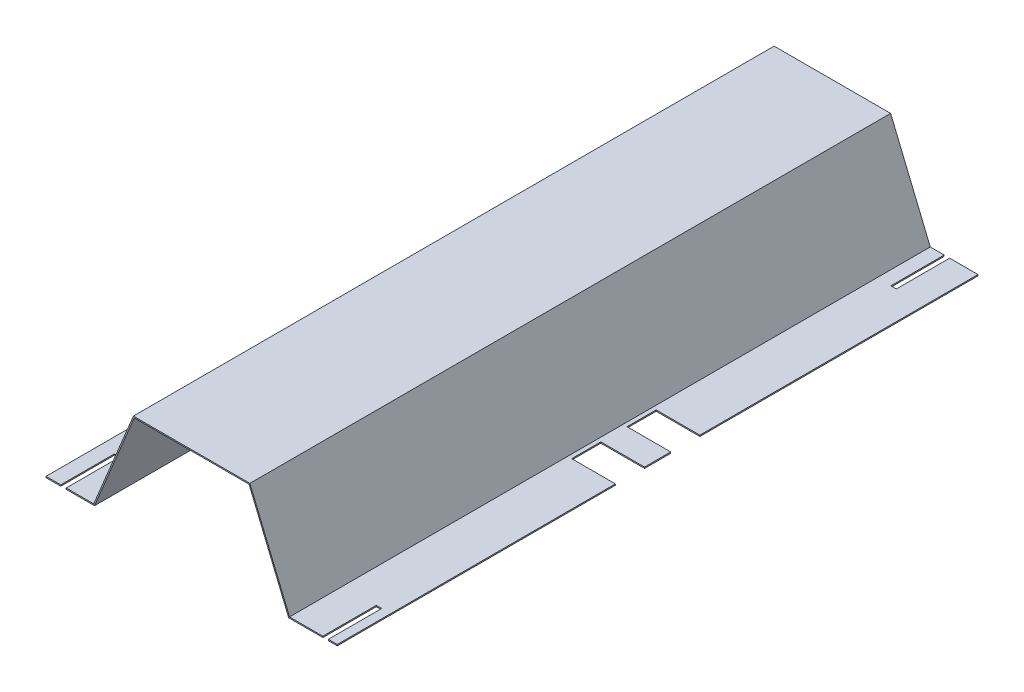
ISO-10303-21;
HEADER;
FILE_DESCRIPTION(('STEP AP214'),'2;1');
FILE_NAME('part.step','',(''),(''),'','','');
FILE_SCHEMA(('AUTOMOTIVE_DESIGN { 1 0 10303 214 1 1 1 1 }'));
ENDSEC;
DATA;
#1=APPLICATION_CONTEXT('core data for automotive mechanical design processes');
#2=APPLICATION_PROTOCOL_DEFINITION('international standard','automotive_design',2000,#1);
#3=PRODUCT_CONTEXT('',#1,'mechanical');
#4=PRODUCT('Part','Part','',(#3));
#5=PRODUCT_RELATED_PRODUCT_CATEGORY('part','',(#4));
#6=PRODUCT_DEFINITION_FORMATION('','',#4);
#7=PRODUCT_DEFINITION_CONTEXT('part definition',#1,'design');
#8=PRODUCT_DEFINITION('design','',#6,#7);
#9=PRODUCT_DEFINITION_SHAPE('','',#8);
#10=(LENGTH_UNIT() NAMED_UNIT(*) SI_UNIT(.MILLI.,.METRE.));
#11=(NAMED_UNIT(*) PLANE_ANGLE_UNIT() SI_UNIT($,.RADIAN.));
#12=(NAMED_UNIT(*) SI_UNIT($,.STERADIAN.) SOLID_ANGLE_UNIT());
#13=UNCERTAINTY_MEASURE_WITH_UNIT(LENGTH_MEASURE(1.E-05),#10,'distance_accuracy_value','');
#14=(GEOMETRIC_REPRESENTATION_CONTEXT(3) GLOBAL_UNCERTAINTY_ASSIGNED_CONTEXT((#13)) GLOBAL_UNIT_ASSIGNED_CONTEXT((#10,
#11,#12)) REPRESENTATION_CONTEXT('',''));
#15=CARTESIAN_POINT('',(0.,0.,0.));
#16=DIRECTION('',(0.,0.,1.));
#17=DIRECTION('',(1.,0.,0.));
#18=AXIS2_PLACEMENT_3D('',#15,#16,#17);
#19=CARTESIAN_POINT('',(0.,0.,838.2));
#20=DIRECTION('',(0.,0.,1.));
#21=DIRECTION('',(1.,0.,0.));
#22=AXIS2_PLACEMENT_3D('',#19,#20,#21);
#23=PLANE('',#22);
#24=DIRECTION('',(0.,1.,0.));
#25=VECTOR('',#24,1.);
#26=CARTESIAN_POINT('',(299.550062310937,62.0219614092776,838.2));
#27=LINE('',#26,#25);
#28=CARTESIAN_POINT('',(299.550062310937,62.0219614092776,838.2));
#29=VERTEX_POINT('',#28);
#30=CARTESIAN_POINT('',(299.550062310937,63.6221614092776,838.2));
#31=VERTEX_POINT('',#30);
#32=EDGE_CURVE('E269',#29,#31,#27,.T.);
#33=ORIENTED_EDGE('',*,*,#32,.T.);
#34=DIRECTION('',(-1.,0.,0.));
#35=VECTOR('',#34,1.);
#36=CARTESIAN_POINT('',(318.346062310937,63.6221614092776,838.2));
#37=LINE('',#36,#35);
#38=CARTESIAN_POINT('',(255.915853148502,63.6221614092776,838.2));
#39=VERTEX_POINT('',#38);
#40=EDGE_CURVE('E296',#31,#39,#37,.T.);
#41=ORIENTED_EDGE('',*,*,#40,.T.);
#42=DIRECTION('',(-0.382227329801764,0.924068324504532,0.));
#43=VECTOR('',#42,1.);
#44=CARTESIAN_POINT('',(204.04606231093,189.021961409278,838.2));
#45=LINE('',#44,#43);
#46=CARTESIAN_POINT('',(204.04606231093,189.021961409278,838.2));
#47=VERTEX_POINT('',#46);
#48=EDGE_CURVE('E304',#39,#47,#45,.T.);
#49=ORIENTED_EDGE('',*,*,#48,.T.);
#50=DIRECTION('',(-1.,0.,0.));
#51=VECTOR('',#50,1.);
#52=CARTESIAN_POINT('',(51.6460623109304,189.021961409278,838.2));
#53=LINE('',#52,#51);
#54=CARTESIAN_POINT('',(51.6460623109304,189.021961409278,838.2));
#55=VERTEX_POINT('',#54);
#56=EDGE_CURVE('E306',#47,#55,#53,.T.);
#57=ORIENTED_EDGE('',*,*,#56,.T.);
#58=DIRECTION('',(-0.382227329801764,-0.924068324504532,0.));
#59=VECTOR('',#58,1.);
#60=CARTESIAN_POINT('',(-0.223728526641112,63.6221614092776,838.2));
#61=LINE('',#60,#59);
#62=CARTESIAN_POINT('',(-0.223728526641112,63.6221614092776,838.2));
#63=VERTEX_POINT('',#62);
#64=EDGE_CURVE('E308',#55,#63,#61,.T.);
#65=ORIENTED_EDGE('',*,*,#64,.T.);
#66=DIRECTION('',(-1.,0.,0.));
#67=VECTOR('',#66,1.);
#68=CARTESIAN_POINT('',(-62.6539376890628,63.6221614092776,838.2));
#69=LINE('',#68,#67);
#70=CARTESIAN_POINT('',(-36.2379376890628,63.6221614092776,838.2));
#71=VERTEX_POINT('',#70);
#72=EDGE_CURVE('E464',#63,#71,#69,.T.);
#73=ORIENTED_EDGE('',*,*,#72,.T.);
#74=DIRECTION('',(0.,1.,0.));
#75=VECTOR('',#74,1.);
#76=CARTESIAN_POINT('',(-36.2379376890628,62.0219614092776,838.2));
#77=LINE('',#76,#75);
#78=CARTESIAN_POINT('',(-36.2379376890628,62.0219614092776,838.2));
#79=VERTEX_POINT('',#78);
#80=EDGE_CURVE('E567',#79,#71,#77,.T.);
#81=ORIENTED_EDGE('',*,*,#80,.F.);
#82=DIRECTION('',(1.,0.,0.));
#83=VECTOR('',#82,1.);
#84=CARTESIAN_POINT('',(0.846062310937231,62.0219614092776,838.2));
#85=LINE('',#84,#83);
#86=CARTESIAN_POINT('',(0.846062310937231,62.0219614092776,838.2));
#87=VERTEX_POINT('',#86);
#88=EDGE_CURVE('E469',#79,#87,#85,.T.);
#89=ORIENTED_EDGE('',*,*,#88,.T.);
#90=DIRECTION('',(0.382227329801764,0.924068324504533,0.));
#91=VECTOR('',#90,1.);
#92=CARTESIAN_POINT('',(52.7158531485087,187.421761409278,838.2));
#93=LINE('',#92,#91);
#94=CARTESIAN_POINT('',(52.7158531485087,187.421761409278,838.2));
#95=VERTEX_POINT('',#94);
#96=EDGE_CURVE('E471',#87,#95,#93,.T.);
#97=ORIENTED_EDGE('',*,*,#96,.T.);
#98=DIRECTION('',(1.,0.,0.));
#99=VECTOR('',#98,1.);
#100=CARTESIAN_POINT('',(202.976271473366,187.421761409278,838.2));
#101=LINE('',#100,#99);
#102=CARTESIAN_POINT('',(202.976271473366,187.421761409278,838.2));
#103=VERTEX_POINT('',#102);
#104=EDGE_CURVE('E472',#95,#103,#101,.T.);
#105=ORIENTED_EDGE('',*,*,#104,.T.);
#106=DIRECTION('',(0.382227329801763,-0.924068324504533,0.));
#107=VECTOR('',#106,1.);
#108=CARTESIAN_POINT('',(254.846062310937,62.0219614092776,838.2));
#109=LINE('',#108,#107);
#110=CARTESIAN_POINT('',(254.846062310937,62.0219614092776,838.2));
#111=VERTEX_POINT('',#110);
#112=EDGE_CURVE('E291',#103,#111,#109,.T.);
#113=ORIENTED_EDGE('',*,*,#112,.T.);
#114=DIRECTION('',(1.,0.,0.));
#115=VECTOR('',#114,1.);
#116=CARTESIAN_POINT('',(254.846062310937,62.0219614092776,838.2));
#117=LINE('',#116,#115);
#118=EDGE_CURVE('E286',#111,#29,#117,.T.);
#119=ORIENTED_EDGE('',*,*,#118,.T.);
#120=EDGE_LOOP('',(#33,#41,#49,#57,#65,#73,#81,#89,#97,#105,#113,#119));
#121=FACE_BOUND('',#120,.T.);
#122=ADVANCED_FACE('F36',(#121),#23,.T.);
#123=DIRECTION('',(0.,1.,0.));
#124=VECTOR('',#123,1.);
#125=CARTESIAN_POINT('',(-43.3499376890628,62.0219614092776,838.2));
#126=LINE('',#125,#124);
#127=CARTESIAN_POINT('',(-43.3499376890628,62.0219614092776,838.2));
#128=VERTEX_POINT('',#127);
#129=CARTESIAN_POINT('',(-43.3499376890628,63.6221614092776,838.2));
#130=VERTEX_POINT('',#129);
#131=EDGE_CURVE('E564',#128,#130,#126,.T.);
#132=ORIENTED_EDGE('',*,*,#131,.T.);
#133=CARTESIAN_POINT('',(-62.6539376890628,63.6221614092776,838.2));
#134=VERTEX_POINT('',#133);
#135=EDGE_CURVE('E344',#130,#134,#69,.T.);
#136=ORIENTED_EDGE('',*,*,#135,.T.);
#137=DIRECTION('',(0.,-1.,0.));
#138=VECTOR('',#137,1.);
#139=CARTESIAN_POINT('',(-62.6539376890628,62.0219614092776,838.2));
#140=LINE('',#139,#138);
#141=CARTESIAN_POINT('',(-62.6539376890628,62.0219614092776,838.2));
#142=VERTEX_POINT('',#141);
#143=EDGE_CURVE('E467',#134,#142,#140,.T.);
#144=ORIENTED_EDGE('',*,*,#143,.T.);
#145=EDGE_CURVE('E386',#142,#128,#85,.T.);
#146=ORIENTED_EDGE('',*,*,#145,.T.);
#147=EDGE_LOOP('',(#132,#136,#144,#146));
#148=FACE_BOUND('',#147,.T.);
#149=ADVANCED_FACE('F617',(#148),#23,.T.);
#150=CARTESIAN_POINT('',(0.,0.,0.));
#151=DIRECTION('',(0.,0.,1.));
#152=DIRECTION('',(1.,0.,0.));
#153=AXIS2_PLACEMENT_3D('',#150,#151,#152);
#154=PLANE('',#153);
#155=DIRECTION('',(-1.,0.,0.));
#156=VECTOR('',#155,1.);
#157=CARTESIAN_POINT('',(318.346062310937,63.6221614092776,0.));
#158=LINE('',#157,#156);
#159=CARTESIAN_POINT('',(274.150062310937,63.6221614092776,0.));
#160=VERTEX_POINT('',#159);
#161=CARTESIAN_POINT('',(255.915853148502,63.6221614092776,0.));
#162=VERTEX_POINT('',#161);
#163=EDGE_CURVE('E334',#160,#162,#158,.T.);
#164=ORIENTED_EDGE('',*,*,#163,.F.);
#165=DIRECTION('',(0.,1.,0.));
#166=VECTOR('',#165,1.);
#167=CARTESIAN_POINT('',(274.150062310937,62.0219614092776,0.));
#168=LINE('',#167,#166);
#169=CARTESIAN_POINT('',(274.150062310937,62.0219614092776,0.));
#170=VERTEX_POINT('',#169);
#171=EDGE_CURVE('E489',#170,#160,#168,.T.);
#172=ORIENTED_EDGE('',*,*,#171,.F.);
#173=DIRECTION('',(1.,0.,0.));
#174=VECTOR('',#173,1.);
#175=CARTESIAN_POINT('',(254.846062310937,62.0219614092776,0.));
#176=LINE('',#175,#174);
#177=CARTESIAN_POINT('',(254.846062310937,62.0219614092776,0.));
#178=VERTEX_POINT('',#177);
#179=EDGE_CURVE('E328',#178,#170,#176,.T.);
#180=ORIENTED_EDGE('',*,*,#179,.F.);
#181=DIRECTION('',(0.382227329801763,-0.924068324504533,0.));
#182=VECTOR('',#181,1.);
#183=CARTESIAN_POINT('',(254.846062310937,62.0219614092776,0.));
#184=LINE('',#183,#182);
#185=CARTESIAN_POINT('',(202.976271473366,187.421761409278,0.));
#186=VERTEX_POINT('',#185);
#187=EDGE_CURVE('E325',#186,#178,#184,.T.);
#188=ORIENTED_EDGE('',*,*,#187,.F.);
#189=DIRECTION('',(1.,0.,0.));
#190=VECTOR('',#189,1.);
#191=CARTESIAN_POINT('',(202.976271473366,187.421761409278,0.));
#192=LINE('',#191,#190);
#193=CARTESIAN_POINT('',(52.7158531485087,187.421761409278,0.));
#194=VERTEX_POINT('',#193);
#195=EDGE_CURVE('E323',#194,#186,#192,.T.);
#196=ORIENTED_EDGE('',*,*,#195,.F.);
#197=DIRECTION('',(0.382227329801764,0.924068324504533,0.));
#198=VECTOR('',#197,1.);
#199=CARTESIAN_POINT('',(52.7158531485087,187.421761409278,0.));
#200=LINE('',#199,#198);
#201=CARTESIAN_POINT('',(0.846062310937231,62.0219614092776,0.));
#202=VERTEX_POINT('',#201);
#203=EDGE_CURVE('E321',#202,#194,#200,.T.);
#204=ORIENTED_EDGE('',*,*,#203,.F.);
#205=DIRECTION('',(1.,0.,0.));
#206=VECTOR('',#205,1.);
#207=CARTESIAN_POINT('',(0.846062310937231,62.0219614092776,0.));
#208=LINE('',#207,#206);
#209=CARTESIAN_POINT('',(-23.5379376890628,62.0219614092776,0.));
#210=VERTEX_POINT('',#209);
#211=EDGE_CURVE('E317',#210,#202,#208,.T.);
#212=ORIENTED_EDGE('',*,*,#211,.F.);
#213=DIRECTION('',(0.,1.,0.));
#214=VECTOR('',#213,1.);
#215=CARTESIAN_POINT('',(-23.5379376890628,62.0219614092776,0.));
#216=LINE('',#215,#214);
#217=CARTESIAN_POINT('',(-23.5379376890628,63.6221614092776,0.));
#218=VERTEX_POINT('',#217);
#219=EDGE_CURVE('E399',#210,#218,#216,.T.);
#220=ORIENTED_EDGE('',*,*,#219,.T.);
#221=DIRECTION('',(-1.,0.,0.));
#222=VECTOR('',#221,1.);
#223=CARTESIAN_POINT('',(-62.6539376890628,63.6221614092776,0.));
#224=LINE('',#223,#222);
#225=CARTESIAN_POINT('',(-0.223728526641112,63.6221614092776,0.));
#226=VERTEX_POINT('',#225);
#227=EDGE_CURVE('E311',#226,#218,#224,.T.);
#228=ORIENTED_EDGE('',*,*,#227,.F.);
#229=DIRECTION('',(-0.382227329801764,-0.924068324504532,0.));
#230=VECTOR('',#229,1.);
#231=CARTESIAN_POINT('',(-0.223728526641112,63.6221614092776,0.));
#232=LINE('',#231,#230);
#233=CARTESIAN_POINT('',(51.6460623109304,189.021961409278,0.));
#234=VERTEX_POINT('',#233);
#235=EDGE_CURVE('E342',#234,#226,#232,.T.);
#236=ORIENTED_EDGE('',*,*,#235,.F.);
#237=DIRECTION('',(-1.,0.,0.));
#238=VECTOR('',#237,1.);
#239=CARTESIAN_POINT('',(51.6460623109304,189.021961409278,0.));
#240=LINE('',#239,#238);
#241=CARTESIAN_POINT('',(204.04606231093,189.021961409278,0.));
#242=VERTEX_POINT('',#241);
#243=EDGE_CURVE('E340',#242,#234,#240,.T.);
#244=ORIENTED_EDGE('',*,*,#243,.F.);
#245=DIRECTION('',(-0.382227329801764,0.924068324504532,0.));
#246=VECTOR('',#245,1.);
#247=CARTESIAN_POINT('',(204.04606231093,189.021961409278,0.));
#248=LINE('',#247,#246);
#249=EDGE_CURVE('E338',#162,#242,#248,.T.);
#250=ORIENTED_EDGE('',*,*,#249,.F.);
#251=EDGE_LOOP('',(#164,#172,#180,#188,#196,#204,#212,#220,#228,#236,#244,#250));
#252=FACE_BOUND('',#251,.T.);
#253=ADVANCED_FACE('F488',(#252),#154,.F.);
#254=CARTESIAN_POINT('',(-30.6499376890628,63.6221614092776,0.));
#255=VERTEX_POINT('',#254);
#256=CARTESIAN_POINT('',(-62.6539376890628,63.6221614092776,0.));
#257=VERTEX_POINT('',#256);
#258=EDGE_CURVE('E315',#255,#257,#224,.T.);
#259=ORIENTED_EDGE('',*,*,#258,.F.);
#260=DIRECTION('',(0.,1.,0.));
#261=VECTOR('',#260,1.);
#262=CARTESIAN_POINT('',(-30.6499376890628,62.0219614092776,0.));
#263=LINE('',#262,#261);
#264=CARTESIAN_POINT('',(-30.6499376890628,62.0219614092776,0.));
#265=VERTEX_POINT('',#264);
#266=EDGE_CURVE('E394',#265,#255,#263,.T.);
#267=ORIENTED_EDGE('',*,*,#266,.F.);
#268=CARTESIAN_POINT('',(-62.6539376890628,62.0219614092776,0.));
#269=VERTEX_POINT('',#268);
#270=EDGE_CURVE('E318',#269,#265,#208,.T.);
#271=ORIENTED_EDGE('',*,*,#270,.F.);
#272=DIRECTION('',(0.,-1.,0.));
#273=VECTOR('',#272,1.);
#274=CARTESIAN_POINT('',(-62.6539376890628,62.0219614092776,0.));
#275=LINE('',#274,#273);
#276=EDGE_CURVE('E314',#257,#269,#275,.T.);
#277=ORIENTED_EDGE('',*,*,#276,.F.);
#278=EDGE_LOOP('',(#259,#267,#271,#277));
#279=FACE_BOUND('',#278,.T.);
#280=ADVANCED_FACE('F393',(#279),#154,.F.);
#281=CARTESIAN_POINT('',(318.346062310937,62.0219614092776,838.2));
#282=DIRECTION('',(-1.,0.,0.));
#283=DIRECTION('',(0.,0.,1.));
#284=AXIS2_PLACEMENT_3D('',#281,#282,#283);
#285=PLANE('',#284);
#286=DIRECTION('',(0.,0.,-1.));
#287=VECTOR('',#286,1.);
#288=CARTESIAN_POINT('',(318.346062310937,62.0219614092776,838.2));
#289=LINE('',#288,#287);
#290=CARTESIAN_POINT('',(318.346062310937,62.0219614092776,838.2));
#291=VERTEX_POINT('',#290);
#292=CARTESIAN_POINT('',(318.346062310937,62.0219614092776,474.345));
#293=VERTEX_POINT('',#292);
#294=EDGE_CURVE('E362',#291,#293,#289,.T.);
#295=ORIENTED_EDGE('',*,*,#294,.T.);
#296=DIRECTION('',(0.,1.,0.));
#297=VECTOR('',#296,1.);
#298=CARTESIAN_POINT('',(318.346062310937,61.0821614092776,474.345));
#299=LINE('',#298,#297);
#300=CARTESIAN_POINT('',(318.346062310937,63.6221614092776,474.345));
#301=VERTEX_POINT('',#300);
#302=EDGE_CURVE('E420',#293,#301,#299,.T.);
#303=ORIENTED_EDGE('',*,*,#302,.T.);
#304=DIRECTION('',(0.,0.,-1.));
#305=VECTOR('',#304,1.);
#306=CARTESIAN_POINT('',(318.346062310937,63.6221614092776,838.2));
#307=LINE('',#306,#305);
#308=CARTESIAN_POINT('',(318.346062310937,63.6221614092776,838.2));
#309=VERTEX_POINT('',#308);
#310=EDGE_CURVE('E357',#309,#301,#307,.T.);
#311=ORIENTED_EDGE('',*,*,#310,.F.);
#312=DIRECTION('',(0.,1.,0.));
#313=VECTOR('',#312,1.);
#314=CARTESIAN_POINT('',(318.346062310937,62.0219614092776,838.2));
#315=LINE('',#314,#313);
#316=EDGE_CURVE('E293',#291,#309,#315,.T.);
#317=ORIENTED_EDGE('',*,*,#316,.F.);
#318=EDGE_LOOP('',(#295,#303,#311,#317));
#319=FACE_BOUND('',#318,.T.);
#320=ADVANCED_FACE('F647',(#319),#285,.F.);
#321=CARTESIAN_POINT('',(318.346062310937,63.6221614092776,436.245));
#322=VERTEX_POINT('',#321);
#323=CARTESIAN_POINT('',(318.346062310937,63.6221614092776,401.955));
#324=VERTEX_POINT('',#323);
#325=EDGE_CURVE('E361',#322,#324,#307,.T.);
#326=ORIENTED_EDGE('',*,*,#325,.F.);
#327=DIRECTION('',(0.,1.,0.));
#328=VECTOR('',#327,1.);
#329=CARTESIAN_POINT('',(318.346062310937,61.0821614092776,436.245));
#330=LINE('',#329,#328);
#331=CARTESIAN_POINT('',(318.346062310937,62.0219614092776,436.245));
#332=VERTEX_POINT('',#331);
#333=EDGE_CURVE('E419',#332,#322,#330,.T.);
#334=ORIENTED_EDGE('',*,*,#333,.F.);
#335=CARTESIAN_POINT('',(318.346062310937,62.0219614092776,401.955));
#336=VERTEX_POINT('',#335);
#337=EDGE_CURVE('E366',#332,#336,#289,.T.);
#338=ORIENTED_EDGE('',*,*,#337,.T.);
#339=DIRECTION('',(0.,1.,0.));
#340=VECTOR('',#339,1.);
#341=CARTESIAN_POINT('',(318.346062310937,61.0821614092776,401.955));
#342=LINE('',#341,#340);
#343=EDGE_CURVE('E447',#336,#324,#342,.T.);
#344=ORIENTED_EDGE('',*,*,#343,.T.);
#345=EDGE_LOOP('',(#326,#334,#338,#344));
#346=FACE_BOUND('',#345,.T.);
#347=ADVANCED_FACE('F648',(#346),#285,.F.);
#348=CARTESIAN_POINT('',(-62.6539376890628,63.6221614092776,838.2));
#349=DIRECTION('',(0.,-1.,0.));
#350=DIRECTION('',(0.,0.,-1.));
#351=AXIS2_PLACEMENT_3D('',#348,#349,#350);
#352=PLANE('',#351);
#353=ORIENTED_EDGE('',*,*,#135,.F.);
#354=DIRECTION('',(0.,0.,1.));
#355=VECTOR('',#354,1.);
#356=CARTESIAN_POINT('',(-43.3499376890628,63.6221614092776,838.2));
#357=LINE('',#356,#355);
#358=CARTESIAN_POINT('',(-43.3499376890628,63.6221614092776,768.35));
#359=VERTEX_POINT('',#358);
#360=EDGE_CURVE('E578',#359,#130,#357,.T.);
#361=ORIENTED_EDGE('',*,*,#360,.F.);
#362=DIRECTION('',(-1.,0.,0.));
#363=VECTOR('',#362,1.);
#364=CARTESIAN_POINT('',(-43.3499376890628,63.6221614092776,768.35));
#365=LINE('',#364,#363);
#366=CARTESIAN_POINT('',(-36.2379376890628,63.6221614092776,768.35));
#367=VERTEX_POINT('',#366);
#368=EDGE_CURVE('E571',#367,#359,#365,.T.);
#369=ORIENTED_EDGE('',*,*,#368,.F.);
#370=DIRECTION('',(0.,0.,-1.));
#371=VECTOR('',#370,1.);
#372=CARTESIAN_POINT('',(-36.2379376890628,63.6221614092776,838.2));
#373=LINE('',#372,#371);
#374=EDGE_CURVE('E575',#71,#367,#373,.T.);
#375=ORIENTED_EDGE('',*,*,#374,.F.);
#376=ORIENTED_EDGE('',*,*,#72,.F.);
#377=DIRECTION('',(0.,0.,-1.));
#378=VECTOR('',#377,1.);
#379=CARTESIAN_POINT('',(-0.223728526641112,63.6221614092776,838.2));
#380=LINE('',#379,#378);
#381=EDGE_CURVE('E310',#63,#226,#380,.T.);
#382=ORIENTED_EDGE('',*,*,#381,.T.);
#383=ORIENTED_EDGE('',*,*,#227,.T.);
#384=DIRECTION('',(0.,0.,-1.));
#385=VECTOR('',#384,1.);
#386=CARTESIAN_POINT('',(-23.5379376890628,63.6221614092776,0.));
#387=LINE('',#386,#385);
#388=CARTESIAN_POINT('',(-23.5379376890628,63.6221614092776,69.85));
#389=VERTEX_POINT('',#388);
#390=EDGE_CURVE('E408',#389,#218,#387,.T.);
#391=ORIENTED_EDGE('',*,*,#390,.F.);
#392=DIRECTION('',(1.,0.,0.));
#393=VECTOR('',#392,1.);
#394=CARTESIAN_POINT('',(-30.6499376890628,63.6221614092776,69.85));
#395=LINE('',#394,#393);
#396=CARTESIAN_POINT('',(-30.6499376890628,63.6221614092776,69.85));
#397=VERTEX_POINT('',#396);
#398=EDGE_CURVE('E497',#397,#389,#395,.T.);
#399=ORIENTED_EDGE('',*,*,#398,.F.);
#400=DIRECTION('',(0.,0.,1.));
#401=VECTOR('',#400,1.);
#402=CARTESIAN_POINT('',(-30.6499376890628,63.6221614092776,0.));
#403=LINE('',#402,#401);
#404=EDGE_CURVE('E494',#255,#397,#403,.T.);
#405=ORIENTED_EDGE('',*,*,#404,.F.);
#406=ORIENTED_EDGE('',*,*,#258,.T.);
#407=DIRECTION('',(0.,0.,-1.));
#408=VECTOR('',#407,1.);
#409=CARTESIAN_POINT('',(-62.6539376890628,63.6221614092776,838.2));
#410=LINE('',#409,#408);
#411=EDGE_CURVE('E11',#134,#257,#410,.T.);
#412=ORIENTED_EDGE('',*,*,#411,.F.);
#413=EDGE_LOOP('',(#353,#361,#369,#375,#376,#382,#383,#391,#399,#405,#406,#412));
#414=FACE_BOUND('',#413,.T.);
#415=ADVANCED_FACE('F38',(#414),#352,.F.);
#416=CARTESIAN_POINT('',(-62.6539376890628,62.0219614092776,838.2));
#417=DIRECTION('',(1.,0.,0.));
#418=DIRECTION('',(0.,0.,-1.));
#419=AXIS2_PLACEMENT_3D('',#416,#417,#418);
#420=PLANE('',#419);
#421=ORIENTED_EDGE('',*,*,#276,.T.);
#422=DIRECTION('',(0.,0.,-1.));
#423=VECTOR('',#422,1.);
#424=CARTESIAN_POINT('',(-62.6539376890628,62.0219614092776,838.2));
#425=LINE('',#424,#423);
#426=EDGE_CURVE('E44',#142,#269,#425,.T.);
#427=ORIENTED_EDGE('',*,*,#426,.F.);
#428=ORIENTED_EDGE('',*,*,#143,.F.);
#429=ORIENTED_EDGE('',*,*,#411,.T.);
#430=EDGE_LOOP('',(#421,#427,#428,#429));
#431=FACE_BOUND('',#430,.T.);
#432=ADVANCED_FACE('F660',(#431),#420,.F.);
#433=CARTESIAN_POINT('',(0.846062310937231,62.0219614092776,838.2));
#434=DIRECTION('',(0.,1.,0.));
#435=DIRECTION('',(-1.,0.,0.));
#436=AXIS2_PLACEMENT_3D('',#433,#434,#435);
#437=PLANE('',#436);
#438=DIRECTION('',(-1.,0.,0.));
#439=VECTOR('',#438,1.);
#440=CARTESIAN_POINT('',(-43.3499376890628,62.0219614092776,768.35));
#441=LINE('',#440,#439);
#442=CARTESIAN_POINT('',(-36.2379376890628,62.0219614092776,768.35));
#443=VERTEX_POINT('',#442);
#444=CARTESIAN_POINT('',(-43.3499376890628,62.0219614092776,768.35));
#445=VERTEX_POINT('',#444);
#446=EDGE_CURVE('E568',#443,#445,#441,.T.);
#447=ORIENTED_EDGE('',*,*,#446,.T.);
#448=DIRECTION('',(0.,0.,1.));
#449=VECTOR('',#448,1.);
#450=CARTESIAN_POINT('',(-43.3499376890628,62.0219614092776,838.2));
#451=LINE('',#450,#449);
#452=EDGE_CURVE('E574',#445,#128,#451,.T.);
#453=ORIENTED_EDGE('',*,*,#452,.T.);
#454=ORIENTED_EDGE('',*,*,#145,.F.);
#455=ORIENTED_EDGE('',*,*,#426,.T.);
#456=ORIENTED_EDGE('',*,*,#270,.T.);
#457=DIRECTION('',(0.,0.,1.));
#458=VECTOR('',#457,1.);
#459=CARTESIAN_POINT('',(-30.6499376890628,62.0219614092776,0.));
#460=LINE('',#459,#458);
#461=CARTESIAN_POINT('',(-30.6499376890628,62.0219614092776,69.85));
#462=VERTEX_POINT('',#461);
#463=EDGE_CURVE('E510',#265,#462,#460,.T.);
#464=ORIENTED_EDGE('',*,*,#463,.T.);
#465=DIRECTION('',(1.,0.,0.));
#466=VECTOR('',#465,1.);
#467=CARTESIAN_POINT('',(-30.6499376890628,62.0219614092776,69.85));
#468=LINE('',#467,#466);
#469=CARTESIAN_POINT('',(-23.5379376890628,62.0219614092776,69.85));
#470=VERTEX_POINT('',#469);
#471=EDGE_CURVE('E512',#462,#470,#468,.T.);
#472=ORIENTED_EDGE('',*,*,#471,.T.);
#473=DIRECTION('',(0.,0.,-1.));
#474=VECTOR('',#473,1.);
#475=CARTESIAN_POINT('',(-23.5379376890628,62.0219614092776,0.));
#476=LINE('',#475,#474);
#477=EDGE_CURVE('E413',#470,#210,#476,.T.);
#478=ORIENTED_EDGE('',*,*,#477,.T.);
#479=ORIENTED_EDGE('',*,*,#211,.T.);
#480=DIRECTION('',(0.,0.,-1.));
#481=VECTOR('',#480,1.);
#482=CARTESIAN_POINT('',(0.846062310937231,62.0219614092776,838.2));
#483=LINE('',#482,#481);
#484=EDGE_CURVE('E374',#87,#202,#483,.T.);
#485=ORIENTED_EDGE('',*,*,#484,.F.);
#486=ORIENTED_EDGE('',*,*,#88,.F.);
#487=DIRECTION('',(0.,0.,-1.));
#488=VECTOR('',#487,1.);
#489=CARTESIAN_POINT('',(-36.2379376890628,62.0219614092776,838.2));
#490=LINE('',#489,#488);
#491=EDGE_CURVE('E59',#79,#443,#490,.T.);
#492=ORIENTED_EDGE('',*,*,#491,.T.);
#493=EDGE_LOOP('',(#447,#453,#454,#455,#456,#464,#472,#478,#479,#485,#486,#492));
#494=FACE_BOUND('',#493,.T.);
#495=ADVANCED_FACE('F382',(#494),#437,.F.);
#496=CARTESIAN_POINT('',(52.7158531485087,187.421761409278,838.2));
#497=DIRECTION('',(-0.924068324504532,0.382227329801764,0.));
#498=DIRECTION('',(-0.382227329801764,-0.924068324504532,0.));
#499=AXIS2_PLACEMENT_3D('',#496,#497,#498);
#500=PLANE('',#499);
#501=ORIENTED_EDGE('',*,*,#203,.T.);
#502=DIRECTION('',(0.,0.,-1.));
#503=VECTOR('',#502,1.);
#504=CARTESIAN_POINT('',(52.7158531485087,187.421761409278,838.2));
#505=LINE('',#504,#503);
#506=EDGE_CURVE('E371',#95,#194,#505,.T.);
#507=ORIENTED_EDGE('',*,*,#506,.F.);
#508=ORIENTED_EDGE('',*,*,#96,.F.);
#509=ORIENTED_EDGE('',*,*,#484,.T.);
#510=EDGE_LOOP('',(#501,#507,#508,#509));
#511=FACE_BOUND('',#510,.T.);
#512=ADVANCED_FACE('F655',(#511),#500,.F.);
#513=CARTESIAN_POINT('',(202.976271473366,187.421761409278,838.2));
#514=DIRECTION('',(0.,1.,0.));
#515=DIRECTION('',(0.,0.,1.));
#516=AXIS2_PLACEMENT_3D('',#513,#514,#515);
#517=PLANE('',#516);
#518=ORIENTED_EDGE('',*,*,#195,.T.);
#519=DIRECTION('',(0.,0.,-1.));
#520=VECTOR('',#519,1.);
#521=CARTESIAN_POINT('',(202.976271473366,187.421761409278,838.2));
#522=LINE('',#521,#520);
#523=EDGE_CURVE('E368',#103,#186,#522,.T.);
#524=ORIENTED_EDGE('',*,*,#523,.F.);
#525=ORIENTED_EDGE('',*,*,#104,.F.);
#526=ORIENTED_EDGE('',*,*,#506,.T.);
#527=EDGE_LOOP('',(#518,#524,#525,#526));
#528=FACE_BOUND('',#527,.T.);
#529=ADVANCED_FACE('F478',(#528),#517,.F.);
#530=CARTESIAN_POINT('',(254.846062310937,62.0219614092776,838.2));
#531=DIRECTION('',(0.924068324504533,0.382227329801763,0.));
#532=DIRECTION('',(-0.382227329801763,0.924068324504533,0.));
#533=AXIS2_PLACEMENT_3D('',#530,#531,#532);
#534=PLANE('',#533);
#535=ORIENTED_EDGE('',*,*,#187,.T.);
#536=DIRECTION('',(0.,0.,-1.));
#537=VECTOR('',#536,1.);
#538=CARTESIAN_POINT('',(254.846062310937,62.0219614092776,838.2));
#539=LINE('',#538,#537);
#540=EDGE_CURVE('E365',#111,#178,#539,.T.);
#541=ORIENTED_EDGE('',*,*,#540,.F.);
#542=ORIENTED_EDGE('',*,*,#112,.F.);
#543=ORIENTED_EDGE('',*,*,#523,.T.);
#544=EDGE_LOOP('',(#535,#541,#542,#543));
#545=FACE_BOUND('',#544,.T.);
#546=ADVANCED_FACE('F482',(#545),#534,.F.);
#547=CARTESIAN_POINT('',(254.846062310937,62.0219614092776,838.2));
#548=DIRECTION('',(0.,1.,0.));
#549=DIRECTION('',(0.,0.,1.));
#550=AXIS2_PLACEMENT_3D('',#547,#548,#549);
#551=PLANE('',#550);
#552=DIRECTION('',(-1.,0.,0.));
#553=VECTOR('',#552,1.);
#554=CARTESIAN_POINT('',(299.550062310937,62.0219614092776,768.35));
#555=LINE('',#554,#553);
#556=CARTESIAN_POINT('',(306.662062310937,62.0219614092776,768.35));
#557=VERTEX_POINT('',#556);
#558=CARTESIAN_POINT('',(299.550062310937,62.0219614092776,768.35));
#559=VERTEX_POINT('',#558);
#560=EDGE_CURVE('E280',#557,#559,#555,.T.);
#561=ORIENTED_EDGE('',*,*,#560,.T.);
#562=DIRECTION('',(0.,0.,1.));
#563=VECTOR('',#562,1.);
#564=CARTESIAN_POINT('',(299.550062310937,62.0219614092776,838.2));
#565=LINE('',#564,#563);
#566=EDGE_CURVE('E272',#559,#29,#565,.T.);
#567=ORIENTED_EDGE('',*,*,#566,.T.);
#568=ORIENTED_EDGE('',*,*,#118,.F.);
#569=ORIENTED_EDGE('',*,*,#540,.T.);
#570=ORIENTED_EDGE('',*,*,#179,.T.);
#571=DIRECTION('',(0.,0.,1.));
#572=VECTOR('',#571,1.);
#573=CARTESIAN_POINT('',(274.150062310937,62.0219614092776,0.));
#574=LINE('',#573,#572);
#575=CARTESIAN_POINT('',(274.150062310937,62.0219614092776,69.85));
#576=VERTEX_POINT('',#575);
#577=EDGE_CURVE('E562',#170,#576,#574,.T.);
#578=ORIENTED_EDGE('',*,*,#577,.T.);
#579=DIRECTION('',(1.,0.,0.));
#580=VECTOR('',#579,1.);
#581=CARTESIAN_POINT('',(274.150062310937,62.0219614092776,69.85));
#582=LINE('',#581,#580);
#583=CARTESIAN_POINT('',(281.262062310937,62.0219614092776,69.85));
#584=VERTEX_POINT('',#583);
#585=EDGE_CURVE('E559',#576,#584,#582,.T.);
#586=ORIENTED_EDGE('',*,*,#585,.T.);
#587=DIRECTION('',(0.,0.,-1.));
#588=VECTOR('',#587,1.);
#589=CARTESIAN_POINT('',(281.262062310937,62.0219614092776,0.));
#590=LINE('',#589,#588);
#591=CARTESIAN_POINT('',(281.262062310937,62.0219614092776,0.));
#592=VERTEX_POINT('',#591);
#593=EDGE_CURVE('E509',#584,#592,#590,.T.);
#594=ORIENTED_EDGE('',*,*,#593,.T.);
#595=CARTESIAN_POINT('',(318.346062310937,62.0219614092776,0.));
#596=VERTEX_POINT('',#595);
#597=EDGE_CURVE('E327',#592,#596,#176,.T.);
#598=ORIENTED_EDGE('',*,*,#597,.T.);
#599=CARTESIAN_POINT('',(318.346062310937,62.0219614092776,363.855));
#600=VERTEX_POINT('',#599);
#601=EDGE_CURVE('E360',#600,#596,#289,.T.);
#602=ORIENTED_EDGE('',*,*,#601,.F.);
#603=DIRECTION('',(-1.,0.,0.));
#604=VECTOR('',#603,1.);
#605=CARTESIAN_POINT('',(254.846062310937,62.0219614092776,363.855));
#606=LINE('',#605,#604);
#607=CARTESIAN_POINT('',(261.196062310937,62.0219614092776,363.855));
#608=VERTEX_POINT('',#607);
#609=EDGE_CURVE('E450',#600,#608,#606,.T.);
#610=ORIENTED_EDGE('',*,*,#609,.T.);
#611=DIRECTION('',(0.,0.,1.));
#612=VECTOR('',#611,1.);
#613=CARTESIAN_POINT('',(261.196062310937,62.0219614092776,838.2));
#614=LINE('',#613,#612);
#615=CARTESIAN_POINT('',(261.196062310937,62.0219614092776,401.955));
#616=VERTEX_POINT('',#615);
#617=EDGE_CURVE('E458',#608,#616,#614,.T.);
#618=ORIENTED_EDGE('',*,*,#617,.T.);
#619=DIRECTION('',(1.,0.,0.));
#620=VECTOR('',#619,1.);
#621=CARTESIAN_POINT('',(254.846062310937,62.0219614092776,401.955));
#622=LINE('',#621,#620);
#623=EDGE_CURVE('E461',#616,#336,#622,.T.);
#624=ORIENTED_EDGE('',*,*,#623,.T.);
#625=ORIENTED_EDGE('',*,*,#337,.F.);
#626=DIRECTION('',(-1.,0.,0.));
#627=VECTOR('',#626,1.);
#628=CARTESIAN_POINT('',(254.846062310937,62.0219614092776,436.245));
#629=LINE('',#628,#627);
#630=CARTESIAN_POINT('',(261.196062310937,62.0219614092776,436.245));
#631=VERTEX_POINT('',#630);
#632=EDGE_CURVE('E423',#332,#631,#629,.T.);
#633=ORIENTED_EDGE('',*,*,#632,.T.);
#634=DIRECTION('',(0.,0.,1.));
#635=VECTOR('',#634,1.);
#636=CARTESIAN_POINT('',(261.196062310937,62.0219614092776,838.2));
#637=LINE('',#636,#635);
#638=CARTESIAN_POINT('',(261.196062310937,62.0219614092776,474.345));
#639=VERTEX_POINT('',#638);
#640=EDGE_CURVE('E431',#631,#639,#637,.T.);
#641=ORIENTED_EDGE('',*,*,#640,.T.);
#642=DIRECTION('',(1.,0.,0.));
#643=VECTOR('',#642,1.);
#644=CARTESIAN_POINT('',(254.846062310937,62.0219614092776,474.345));
#645=LINE('',#644,#643);
#646=EDGE_CURVE('E434',#639,#293,#645,.T.);
#647=ORIENTED_EDGE('',*,*,#646,.T.);
#648=ORIENTED_EDGE('',*,*,#294,.F.);
#649=CARTESIAN_POINT('',(306.662062310937,62.0219614092776,838.2));
#650=VERTEX_POINT('',#649);
#651=EDGE_CURVE('E294',#650,#291,#117,.T.);
#652=ORIENTED_EDGE('',*,*,#651,.F.);
#653=DIRECTION('',(0.,0.,-1.));
#654=VECTOR('',#653,1.);
#655=CARTESIAN_POINT('',(306.662062310937,62.0219614092776,838.2));
#656=LINE('',#655,#654);
#657=EDGE_CURVE('E51',#650,#557,#656,.T.);
#658=ORIENTED_EDGE('',*,*,#657,.T.);
#659=EDGE_LOOP('',(#561,#567,#568,#569,#570,#578,#586,#594,#598,#602,#610,#618,#624,#625,#633,
#641,#647,#648,#652,#658));
#660=FACE_BOUND('',#659,.T.);
#661=ADVANCED_FACE('F284',(#660),#551,.F.);
#662=CARTESIAN_POINT('',(318.346062310937,63.6221614092776,363.855));
#663=VERTEX_POINT('',#662);
#664=CARTESIAN_POINT('',(318.346062310937,63.6221614092776,0.));
#665=VERTEX_POINT('',#664);
#666=EDGE_CURVE('E356',#663,#665,#307,.T.);
#667=ORIENTED_EDGE('',*,*,#666,.F.);
#668=DIRECTION('',(0.,1.,0.));
#669=VECTOR('',#668,1.);
#670=CARTESIAN_POINT('',(318.346062310937,61.0821614092776,363.855));
#671=LINE('',#670,#669);
#672=EDGE_CURVE('E446',#600,#663,#671,.T.);
#673=ORIENTED_EDGE('',*,*,#672,.F.);
#674=ORIENTED_EDGE('',*,*,#601,.T.);
#675=DIRECTION('',(0.,1.,0.));
#676=VECTOR('',#675,1.);
#677=CARTESIAN_POINT('',(318.346062310937,62.0219614092776,0.));
#678=LINE('',#677,#676);
#679=EDGE_CURVE('E331',#596,#665,#678,.T.);
#680=ORIENTED_EDGE('',*,*,#679,.T.);
#681=EDGE_LOOP('',(#667,#673,#674,#680));
#682=FACE_BOUND('',#681,.T.);
#683=ADVANCED_FACE('F643',(#682),#285,.F.);
#684=CARTESIAN_POINT('',(318.346062310937,63.6221614092776,838.2));
#685=DIRECTION('',(0.,-1.,0.));
#686=DIRECTION('',(0.,0.,-1.));
#687=AXIS2_PLACEMENT_3D('',#684,#685,#686);
#688=PLANE('',#687);
#689=ORIENTED_EDGE('',*,*,#40,.F.);
#690=DIRECTION('',(0.,0.,1.));
#691=VECTOR('',#690,1.);
#692=CARTESIAN_POINT('',(299.550062310937,63.6221614092776,838.2));
#693=LINE('',#692,#691);
#694=CARTESIAN_POINT('',(299.550062310937,63.6221614092776,768.35));
#695=VERTEX_POINT('',#694);
#696=EDGE_CURVE('E275',#695,#31,#693,.T.);
#697=ORIENTED_EDGE('',*,*,#696,.F.);
#698=DIRECTION('',(-1.,0.,0.));
#699=VECTOR('',#698,1.);
#700=CARTESIAN_POINT('',(299.550062310937,63.6221614092776,768.35));
#701=LINE('',#700,#699);
#702=CARTESIAN_POINT('',(306.662062310937,63.6221614092776,768.35));
#703=VERTEX_POINT('',#702);
#704=EDGE_CURVE('E288',#703,#695,#701,.T.);
#705=ORIENTED_EDGE('',*,*,#704,.F.);
#706=DIRECTION('',(0.,0.,-1.));
#707=VECTOR('',#706,1.);
#708=CARTESIAN_POINT('',(306.662062310937,63.6221614092776,838.2));
#709=LINE('',#708,#707);
#710=CARTESIAN_POINT('',(306.662062310937,63.6221614092776,838.2));
#711=VERTEX_POINT('',#710);
#712=EDGE_CURVE('E590',#711,#703,#709,.T.);
#713=ORIENTED_EDGE('',*,*,#712,.F.);
#714=EDGE_CURVE('E301',#309,#711,#37,.T.);
#715=ORIENTED_EDGE('',*,*,#714,.F.);
#716=ORIENTED_EDGE('',*,*,#310,.T.);
#717=DIRECTION('',(1.,0.,0.));
#718=VECTOR('',#717,1.);
#719=CARTESIAN_POINT('',(318.346062310937,63.6221614092776,474.345));
#720=LINE('',#719,#718);
#721=CARTESIAN_POINT('',(261.196062310937,63.6221614092776,474.345));
#722=VERTEX_POINT('',#721);
#723=EDGE_CURVE('E417',#722,#301,#720,.T.);
#724=ORIENTED_EDGE('',*,*,#723,.F.);
#725=DIRECTION('',(0.,0.,1.));
#726=VECTOR('',#725,1.);
#727=CARTESIAN_POINT('',(261.196062310937,63.6221614092776,474.345));
#728=LINE('',#727,#726);
#729=CARTESIAN_POINT('',(261.196062310937,63.6221614092776,436.245));
#730=VERTEX_POINT('',#729);
#731=EDGE_CURVE('E402',#730,#722,#728,.T.);
#732=ORIENTED_EDGE('',*,*,#731,.F.);
#733=DIRECTION('',(-1.,0.,0.));
#734=VECTOR('',#733,1.);
#735=CARTESIAN_POINT('',(318.346062310937,63.6221614092776,436.245));
#736=LINE('',#735,#734);
#737=EDGE_CURVE('E398',#322,#730,#736,.T.);
#738=ORIENTED_EDGE('',*,*,#737,.F.);
#739=ORIENTED_EDGE('',*,*,#325,.T.);
#740=DIRECTION('',(1.,0.,0.));
#741=VECTOR('',#740,1.);
#742=CARTESIAN_POINT('',(318.346062310937,63.6221614092776,401.955));
#743=LINE('',#742,#741);
#744=CARTESIAN_POINT('',(261.196062310937,63.6221614092776,401.955));
#745=VERTEX_POINT('',#744);
#746=EDGE_CURVE('E443',#745,#324,#743,.T.);
#747=ORIENTED_EDGE('',*,*,#746,.F.);
#748=DIRECTION('',(0.,0.,1.));
#749=VECTOR('',#748,1.);
#750=CARTESIAN_POINT('',(261.196062310937,63.6221614092776,363.855));
#751=LINE('',#750,#749);
#752=CARTESIAN_POINT('',(261.196062310937,63.6221614092776,363.855));
#753=VERTEX_POINT('',#752);
#754=EDGE_CURVE('E440',#753,#745,#751,.T.);
#755=ORIENTED_EDGE('',*,*,#754,.F.);
#756=DIRECTION('',(-1.,0.,0.));
#757=VECTOR('',#756,1.);
#758=CARTESIAN_POINT('',(318.346062310937,63.6221614092776,363.855));
#759=LINE('',#758,#757);
#760=EDGE_CURVE('E437',#663,#753,#759,.T.);
#761=ORIENTED_EDGE('',*,*,#760,.F.);
#762=ORIENTED_EDGE('',*,*,#666,.T.);
#763=CARTESIAN_POINT('',(281.262062310937,63.6221614092776,0.));
#764=VERTEX_POINT('',#763);
#765=EDGE_CURVE('E335',#665,#764,#158,.T.);
#766=ORIENTED_EDGE('',*,*,#765,.T.);
#767=DIRECTION('',(0.,0.,-1.));
#768=VECTOR('',#767,1.);
#769=CARTESIAN_POINT('',(281.262062310937,63.6221614092776,0.));
#770=LINE('',#769,#768);
#771=CARTESIAN_POINT('',(281.262062310937,63.6221614092776,69.85));
#772=VERTEX_POINT('',#771);
#773=EDGE_CURVE('E503',#772,#764,#770,.T.);
#774=ORIENTED_EDGE('',*,*,#773,.F.);
#775=DIRECTION('',(1.,0.,0.));
#776=VECTOR('',#775,1.);
#777=CARTESIAN_POINT('',(274.150062310937,63.6221614092776,69.85));
#778=LINE('',#777,#776);
#779=CARTESIAN_POINT('',(274.150062310937,63.6221614092776,69.85));
#780=VERTEX_POINT('',#779);
#781=EDGE_CURVE('E551',#780,#772,#778,.T.);
#782=ORIENTED_EDGE('',*,*,#781,.F.);
#783=DIRECTION('',(0.,0.,1.));
#784=VECTOR('',#783,1.);
#785=CARTESIAN_POINT('',(274.150062310937,63.6221614092776,0.));
#786=LINE('',#785,#784);
#787=EDGE_CURVE('E548',#160,#780,#786,.T.);
#788=ORIENTED_EDGE('',*,*,#787,.F.);
#789=ORIENTED_EDGE('',*,*,#163,.T.);
#790=DIRECTION('',(0.,0.,-1.));
#791=VECTOR('',#790,1.);
#792=CARTESIAN_POINT('',(255.915853148502,63.6221614092776,838.2));
#793=LINE('',#792,#791);
#794=EDGE_CURVE('E353',#39,#162,#793,.T.);
#795=ORIENTED_EDGE('',*,*,#794,.F.);
#796=EDGE_LOOP('',(#689,#697,#705,#713,#715,#716,#724,#732,#738,#739,#747,#755,#761,#762,#766,
#774,#782,#788,#789,#795));
#797=FACE_BOUND('',#796,.T.);
#798=ADVANCED_FACE('F546',(#797),#688,.F.);
#799=CARTESIAN_POINT('',(204.04606231093,189.021961409278,838.2));
#800=DIRECTION('',(-0.924068324504532,-0.382227329801764,0.));
#801=DIRECTION('',(0.382227329801764,-0.924068324504532,0.));
#802=AXIS2_PLACEMENT_3D('',#799,#800,#801);
#803=PLANE('',#802);
#804=ORIENTED_EDGE('',*,*,#249,.T.);
#805=DIRECTION('',(0.,0.,-1.));
#806=VECTOR('',#805,1.);
#807=CARTESIAN_POINT('',(204.04606231093,189.021961409278,838.2));
#808=LINE('',#807,#806);
#809=EDGE_CURVE('E350',#47,#242,#808,.T.);
#810=ORIENTED_EDGE('',*,*,#809,.F.);
#811=ORIENTED_EDGE('',*,*,#48,.F.);
#812=ORIENTED_EDGE('',*,*,#794,.T.);
#813=EDGE_LOOP('',(#804,#810,#811,#812));
#814=FACE_BOUND('',#813,.T.);
#815=ADVANCED_FACE('F543',(#814),#803,.F.);
#816=CARTESIAN_POINT('',(51.6460623109304,189.021961409278,838.2));
#817=DIRECTION('',(0.,-1.,0.));
#818=DIRECTION('',(0.,0.,-1.));
#819=AXIS2_PLACEMENT_3D('',#816,#817,#818);
#820=PLANE('',#819);
#821=ORIENTED_EDGE('',*,*,#243,.T.);
#822=DIRECTION('',(0.,0.,-1.));
#823=VECTOR('',#822,1.);
#824=CARTESIAN_POINT('',(51.6460623109304,189.021961409278,838.2));
#825=LINE('',#824,#823);
#826=EDGE_CURVE('E347',#55,#234,#825,.T.);
#827=ORIENTED_EDGE('',*,*,#826,.F.);
#828=ORIENTED_EDGE('',*,*,#56,.F.);
#829=ORIENTED_EDGE('',*,*,#809,.T.);
#830=EDGE_LOOP('',(#821,#827,#828,#829));
#831=FACE_BOUND('',#830,.T.);
#832=ADVANCED_FACE('F538',(#831),#820,.F.);
#833=CARTESIAN_POINT('',(-0.223728526641112,63.6221614092776,838.2));
#834=DIRECTION('',(0.924068324504532,-0.382227329801764,0.));
#835=DIRECTION('',(0.382227329801764,0.924068324504532,0.));
#836=AXIS2_PLACEMENT_3D('',#833,#834,#835);
#837=PLANE('',#836);
#838=ORIENTED_EDGE('',*,*,#235,.T.);
#839=ORIENTED_EDGE('',*,*,#381,.F.);
#840=ORIENTED_EDGE('',*,*,#64,.F.);
#841=ORIENTED_EDGE('',*,*,#826,.T.);
#842=EDGE_LOOP('',(#838,#839,#840,#841));
#843=FACE_BOUND('',#842,.T.);
#844=ADVANCED_FACE('F534',(#843),#837,.F.);
#845=DIRECTION('',(0.,1.,0.));
#846=VECTOR('',#845,1.);
#847=CARTESIAN_POINT('',(306.662062310937,62.0219614092776,838.2));
#848=LINE('',#847,#846);
#849=EDGE_CURVE('E279',#650,#711,#848,.T.);
#850=ORIENTED_EDGE('',*,*,#849,.F.);
#851=ORIENTED_EDGE('',*,*,#651,.T.);
#852=ORIENTED_EDGE('',*,*,#316,.T.);
#853=ORIENTED_EDGE('',*,*,#714,.T.);
#854=EDGE_LOOP('',(#850,#851,#852,#853));
#855=FACE_BOUND('',#854,.T.);
#856=ADVANCED_FACE('F599',(#855),#23,.T.);
#857=ORIENTED_EDGE('',*,*,#597,.F.);
#858=DIRECTION('',(0.,1.,0.));
#859=VECTOR('',#858,1.);
#860=CARTESIAN_POINT('',(281.262062310937,62.0219614092776,0.));
#861=LINE('',#860,#859);
#862=EDGE_CURVE('E495',#592,#764,#861,.T.);
#863=ORIENTED_EDGE('',*,*,#862,.T.);
#864=ORIENTED_EDGE('',*,*,#765,.F.);
#865=ORIENTED_EDGE('',*,*,#679,.F.);
#866=EDGE_LOOP('',(#857,#863,#864,#865));
#867=FACE_BOUND('',#866,.T.);
#868=ADVANCED_FACE('F626',(#867),#154,.F.);
#869=CARTESIAN_POINT('',(318.346062310937,61.0821614092776,401.955));
#870=DIRECTION('',(0.,0.,1.));
#871=DIRECTION('',(1.,0.,0.));
#872=AXIS2_PLACEMENT_3D('',#869,#870,#871);
#873=PLANE('',#872);
#874=DIRECTION('',(0.,1.,0.));
#875=VECTOR('',#874,1.);
#876=CARTESIAN_POINT('',(261.196062310937,61.0821614092776,401.955));
#877=LINE('',#876,#875);
#878=EDGE_CURVE('E451',#616,#745,#877,.T.);
#879=ORIENTED_EDGE('',*,*,#878,.T.);
#880=ORIENTED_EDGE('',*,*,#746,.T.);
#881=ORIENTED_EDGE('',*,*,#343,.F.);
#882=ORIENTED_EDGE('',*,*,#623,.F.);
#883=EDGE_LOOP('',(#879,#880,#881,#882));
#884=FACE_BOUND('',#883,.T.);
#885=ADVANCED_FACE('F631',(#884),#873,.F.);
#886=CARTESIAN_POINT('',(261.196062310937,61.0821614092776,363.855));
#887=DIRECTION('',(-1.,0.,0.));
#888=DIRECTION('',(0.,0.,1.));
#889=AXIS2_PLACEMENT_3D('',#886,#887,#888);
#890=PLANE('',#889);
#891=DIRECTION('',(0.,1.,0.));
#892=VECTOR('',#891,1.);
#893=CARTESIAN_POINT('',(261.196062310937,61.0821614092776,363.855));
#894=LINE('',#893,#892);
#895=EDGE_CURVE('E453',#608,#753,#894,.T.);
#896=ORIENTED_EDGE('',*,*,#895,.T.);
#897=ORIENTED_EDGE('',*,*,#754,.T.);
#898=ORIENTED_EDGE('',*,*,#878,.F.);
#899=ORIENTED_EDGE('',*,*,#617,.F.);
#900=EDGE_LOOP('',(#896,#897,#898,#899));
#901=FACE_BOUND('',#900,.T.);
#902=ADVANCED_FACE('F719',(#901),#890,.F.);
#903=CARTESIAN_POINT('',(318.346062310937,61.0821614092776,363.855));
#904=DIRECTION('',(0.,0.,-1.));
#905=DIRECTION('',(-1.,0.,0.));
#906=AXIS2_PLACEMENT_3D('',#903,#904,#905);
#907=PLANE('',#906);
#908=ORIENTED_EDGE('',*,*,#672,.T.);
#909=ORIENTED_EDGE('',*,*,#760,.T.);
#910=ORIENTED_EDGE('',*,*,#895,.F.);
#911=ORIENTED_EDGE('',*,*,#609,.F.);
#912=EDGE_LOOP('',(#908,#909,#910,#911));
#913=FACE_BOUND('',#912,.T.);
#914=ADVANCED_FACE('F709',(#913),#907,.F.);
#915=CARTESIAN_POINT('',(318.346062310937,61.0821614092776,474.345));
#916=DIRECTION('',(0.,0.,1.));
#917=DIRECTION('',(1.,0.,0.));
#918=AXIS2_PLACEMENT_3D('',#915,#916,#917);
#919=PLANE('',#918);
#920=DIRECTION('',(0.,1.,0.));
#921=VECTOR('',#920,1.);
#922=CARTESIAN_POINT('',(261.196062310937,61.0821614092776,474.345));
#923=LINE('',#922,#921);
#924=EDGE_CURVE('E424',#639,#722,#923,.T.);
#925=ORIENTED_EDGE('',*,*,#924,.T.);
#926=ORIENTED_EDGE('',*,*,#723,.T.);
#927=ORIENTED_EDGE('',*,*,#302,.F.);
#928=ORIENTED_EDGE('',*,*,#646,.F.);
#929=EDGE_LOOP('',(#925,#926,#927,#928));
#930=FACE_BOUND('',#929,.T.);
#931=ADVANCED_FACE('F705',(#930),#919,.F.);
#932=CARTESIAN_POINT('',(261.196062310937,61.0821614092776,474.345));
#933=DIRECTION('',(-1.,0.,0.));
#934=DIRECTION('',(0.,0.,1.));
#935=AXIS2_PLACEMENT_3D('',#932,#933,#934);
#936=PLANE('',#935);
#937=DIRECTION('',(0.,1.,0.));
#938=VECTOR('',#937,1.);
#939=CARTESIAN_POINT('',(261.196062310937,61.0821614092776,436.245));
#940=LINE('',#939,#938);
#941=EDGE_CURVE('E426',#631,#730,#940,.T.);
#942=ORIENTED_EDGE('',*,*,#941,.T.);
#943=ORIENTED_EDGE('',*,*,#731,.T.);
#944=ORIENTED_EDGE('',*,*,#924,.F.);
#945=ORIENTED_EDGE('',*,*,#640,.F.);
#946=EDGE_LOOP('',(#942,#943,#944,#945));
#947=FACE_BOUND('',#946,.T.);
#948=ADVANCED_FACE('F708',(#947),#936,.F.);
#949=CARTESIAN_POINT('',(318.346062310937,61.0821614092776,436.245));
#950=DIRECTION('',(0.,0.,-1.));
#951=DIRECTION('',(-1.,0.,0.));
#952=AXIS2_PLACEMENT_3D('',#949,#950,#951);
#953=PLANE('',#952);
#954=ORIENTED_EDGE('',*,*,#333,.T.);
#955=ORIENTED_EDGE('',*,*,#737,.T.);
#956=ORIENTED_EDGE('',*,*,#941,.F.);
#957=ORIENTED_EDGE('',*,*,#632,.F.);
#958=EDGE_LOOP('',(#954,#955,#956,#957));
#959=FACE_BOUND('',#958,.T.);
#960=ADVANCED_FACE('F704',(#959),#953,.F.);
#961=CARTESIAN_POINT('',(-30.6499376890628,62.0219614092776,0.));
#962=DIRECTION('',(-1.,0.,0.));
#963=DIRECTION('',(0.,0.,1.));
#964=AXIS2_PLACEMENT_3D('',#961,#962,#963);
#965=PLANE('',#964);
#966=ORIENTED_EDGE('',*,*,#404,.T.);
#967=DIRECTION('',(0.,1.,0.));
#968=VECTOR('',#967,1.);
#969=CARTESIAN_POINT('',(-30.6499376890628,62.0219614092776,69.85));
#970=LINE('',#969,#968);
#971=EDGE_CURVE('E412',#462,#397,#970,.T.);
#972=ORIENTED_EDGE('',*,*,#971,.F.);
#973=ORIENTED_EDGE('',*,*,#463,.F.);
#974=ORIENTED_EDGE('',*,*,#266,.T.);
#975=EDGE_LOOP('',(#966,#972,#973,#974));
#976=FACE_BOUND('',#975,.T.);
#977=ADVANCED_FACE('F667',(#976),#965,.F.);
#978=CARTESIAN_POINT('',(-23.5379376890628,62.0219614092776,0.));
#979=DIRECTION('',(1.,0.,0.));
#980=DIRECTION('',(0.,0.,-1.));
#981=AXIS2_PLACEMENT_3D('',#978,#979,#980);
#982=PLANE('',#981);
#983=ORIENTED_EDGE('',*,*,#390,.T.);
#984=ORIENTED_EDGE('',*,*,#219,.F.);
#985=ORIENTED_EDGE('',*,*,#477,.F.);
#986=DIRECTION('',(0.,1.,0.));
#987=VECTOR('',#986,1.);
#988=CARTESIAN_POINT('',(-23.5379376890628,62.0219614092776,69.85));
#989=LINE('',#988,#987);
#990=EDGE_CURVE('E405',#470,#389,#989,.T.);
#991=ORIENTED_EDGE('',*,*,#990,.T.);
#992=EDGE_LOOP('',(#983,#984,#985,#991));
#993=FACE_BOUND('',#992,.T.);
#994=ADVANCED_FACE('F521',(#993),#982,.F.);
#995=CARTESIAN_POINT('',(-30.6499376890628,62.0219614092776,69.85));
#996=DIRECTION('',(0.,0.,1.));
#997=DIRECTION('',(1.,0.,0.));
#998=AXIS2_PLACEMENT_3D('',#995,#996,#997);
#999=PLANE('',#998);
#1000=ORIENTED_EDGE('',*,*,#398,.T.);
#1001=ORIENTED_EDGE('',*,*,#990,.F.);
#1002=ORIENTED_EDGE('',*,*,#471,.F.);
#1003=ORIENTED_EDGE('',*,*,#971,.T.);
#1004=EDGE_LOOP('',(#1000,#1001,#1002,#1003));
#1005=FACE_BOUND('',#1004,.T.);
#1006=ADVANCED_FACE('F669',(#1005),#999,.F.);
#1007=CARTESIAN_POINT('',(274.150062310937,62.0219614092776,0.));
#1008=DIRECTION('',(-1.,0.,0.));
#1009=DIRECTION('',(0.,0.,1.));
#1010=AXIS2_PLACEMENT_3D('',#1007,#1008,#1009);
#1011=PLANE('',#1010);
#1012=ORIENTED_EDGE('',*,*,#787,.T.);
#1013=DIRECTION('',(0.,1.,0.));
#1014=VECTOR('',#1013,1.);
#1015=CARTESIAN_POINT('',(274.150062310937,62.0219614092776,69.85));
#1016=LINE('',#1015,#1014);
#1017=EDGE_CURVE('E507',#576,#780,#1016,.T.);
#1018=ORIENTED_EDGE('',*,*,#1017,.F.);
#1019=ORIENTED_EDGE('',*,*,#577,.F.);
#1020=ORIENTED_EDGE('',*,*,#171,.T.);
#1021=EDGE_LOOP('',(#1012,#1018,#1019,#1020));
#1022=FACE_BOUND('',#1021,.T.);
#1023=ADVANCED_FACE('F693',(#1022),#1011,.F.);
#1024=CARTESIAN_POINT('',(281.262062310937,62.0219614092776,0.));
#1025=DIRECTION('',(1.,0.,0.));
#1026=DIRECTION('',(0.,0.,-1.));
#1027=AXIS2_PLACEMENT_3D('',#1024,#1025,#1026);
#1028=PLANE('',#1027);
#1029=ORIENTED_EDGE('',*,*,#773,.T.);
#1030=ORIENTED_EDGE('',*,*,#862,.F.);
#1031=ORIENTED_EDGE('',*,*,#593,.F.);
#1032=DIRECTION('',(0.,1.,0.));
#1033=VECTOR('',#1032,1.);
#1034=CARTESIAN_POINT('',(281.262062310937,62.0219614092776,69.85));
#1035=LINE('',#1034,#1033);
#1036=EDGE_CURVE('E500',#584,#772,#1035,.T.);
#1037=ORIENTED_EDGE('',*,*,#1036,.T.);
#1038=EDGE_LOOP('',(#1029,#1030,#1031,#1037));
#1039=FACE_BOUND('',#1038,.T.);
#1040=ADVANCED_FACE('F687',(#1039),#1028,.F.);
#1041=CARTESIAN_POINT('',(274.150062310937,62.0219614092776,69.85));
#1042=DIRECTION('',(0.,0.,1.));
#1043=DIRECTION('',(1.,0.,0.));
#1044=AXIS2_PLACEMENT_3D('',#1041,#1042,#1043);
#1045=PLANE('',#1044);
#1046=ORIENTED_EDGE('',*,*,#781,.T.);
#1047=ORIENTED_EDGE('',*,*,#1036,.F.);
#1048=ORIENTED_EDGE('',*,*,#585,.F.);
#1049=ORIENTED_EDGE('',*,*,#1017,.T.);
#1050=EDGE_LOOP('',(#1046,#1047,#1048,#1049));
#1051=FACE_BOUND('',#1050,.T.);
#1052=ADVANCED_FACE('F680',(#1051),#1045,.F.);
#1053=CARTESIAN_POINT('',(-43.3499376890628,62.0219614092776,838.2));
#1054=DIRECTION('',(-1.,0.,0.));
#1055=DIRECTION('',(0.,0.,1.));
#1056=AXIS2_PLACEMENT_3D('',#1053,#1054,#1055);
#1057=PLANE('',#1056);
#1058=ORIENTED_EDGE('',*,*,#360,.T.);
#1059=ORIENTED_EDGE('',*,*,#131,.F.);
#1060=ORIENTED_EDGE('',*,*,#452,.F.);
#1061=DIRECTION('',(0.,1.,0.));
#1062=VECTOR('',#1061,1.);
#1063=CARTESIAN_POINT('',(-43.3499376890628,62.0219614092776,768.35));
#1064=LINE('',#1063,#1062);
#1065=EDGE_CURVE('E552',#445,#359,#1064,.T.);
#1066=ORIENTED_EDGE('',*,*,#1065,.T.);
#1067=EDGE_LOOP('',(#1058,#1059,#1060,#1066));
#1068=FACE_BOUND('',#1067,.T.);
#1069=ADVANCED_FACE('F678',(#1068),#1057,.F.);
#1070=CARTESIAN_POINT('',(-43.3499376890628,62.0219614092776,768.35));
#1071=DIRECTION('',(0.,0.,-1.));
#1072=DIRECTION('',(-1.,0.,0.));
#1073=AXIS2_PLACEMENT_3D('',#1070,#1071,#1072);
#1074=PLANE('',#1073);
#1075=ORIENTED_EDGE('',*,*,#368,.T.);
#1076=ORIENTED_EDGE('',*,*,#1065,.F.);
#1077=ORIENTED_EDGE('',*,*,#446,.F.);
#1078=DIRECTION('',(0.,1.,0.));
#1079=VECTOR('',#1078,1.);
#1080=CARTESIAN_POINT('',(-36.2379376890628,62.0219614092776,768.35));
#1081=LINE('',#1080,#1079);
#1082=EDGE_CURVE('E554',#443,#367,#1081,.T.);
#1083=ORIENTED_EDGE('',*,*,#1082,.T.);
#1084=EDGE_LOOP('',(#1075,#1076,#1077,#1083));
#1085=FACE_BOUND('',#1084,.T.);
#1086=ADVANCED_FACE('F674',(#1085),#1074,.F.);
#1087=CARTESIAN_POINT('',(-36.2379376890628,62.0219614092776,838.2));
#1088=DIRECTION('',(1.,0.,0.));
#1089=DIRECTION('',(0.,0.,-1.));
#1090=AXIS2_PLACEMENT_3D('',#1087,#1088,#1089);
#1091=PLANE('',#1090);
#1092=ORIENTED_EDGE('',*,*,#374,.T.);
#1093=ORIENTED_EDGE('',*,*,#1082,.F.);
#1094=ORIENTED_EDGE('',*,*,#491,.F.);
#1095=ORIENTED_EDGE('',*,*,#80,.T.);
#1096=EDGE_LOOP('',(#1092,#1093,#1094,#1095));
#1097=FACE_BOUND('',#1096,.T.);
#1098=ADVANCED_FACE('F614',(#1097),#1091,.F.);
#1099=CARTESIAN_POINT('',(299.550062310937,62.0219614092776,838.2));
#1100=DIRECTION('',(-1.,0.,0.));
#1101=DIRECTION('',(0.,0.,1.));
#1102=AXIS2_PLACEMENT_3D('',#1099,#1100,#1101);
#1103=PLANE('',#1102);
#1104=ORIENTED_EDGE('',*,*,#696,.T.);
#1105=ORIENTED_EDGE('',*,*,#32,.F.);
#1106=ORIENTED_EDGE('',*,*,#566,.F.);
#1107=DIRECTION('',(0.,1.,0.));
#1108=VECTOR('',#1107,1.);
#1109=CARTESIAN_POINT('',(299.550062310937,62.0219614092776,768.35));
#1110=LINE('',#1109,#1108);
#1111=EDGE_CURVE('E580',#559,#695,#1110,.T.);
#1112=ORIENTED_EDGE('',*,*,#1111,.T.);
#1113=EDGE_LOOP('',(#1104,#1105,#1106,#1112));
#1114=FACE_BOUND('',#1113,.T.);
#1115=ADVANCED_FACE('F271',(#1114),#1103,.F.);
#1116=CARTESIAN_POINT('',(299.550062310937,62.0219614092776,768.35));
#1117=DIRECTION('',(0.,0.,-1.));
#1118=DIRECTION('',(-1.,0.,0.));
#1119=AXIS2_PLACEMENT_3D('',#1116,#1117,#1118);
#1120=PLANE('',#1119);
#1121=ORIENTED_EDGE('',*,*,#704,.T.);
#1122=ORIENTED_EDGE('',*,*,#1111,.F.);
#1123=ORIENTED_EDGE('',*,*,#560,.F.);
#1124=DIRECTION('',(0.,1.,0.));
#1125=VECTOR('',#1124,1.);
#1126=CARTESIAN_POINT('',(306.662062310937,62.0219614092776,768.35));
#1127=LINE('',#1126,#1125);
#1128=EDGE_CURVE('E585',#557,#703,#1127,.T.);
#1129=ORIENTED_EDGE('',*,*,#1128,.T.);
#1130=EDGE_LOOP('',(#1121,#1122,#1123,#1129));
#1131=FACE_BOUND('',#1130,.T.);
#1132=ADVANCED_FACE('F606',(#1131),#1120,.F.);
#1133=CARTESIAN_POINT('',(306.662062310937,62.0219614092776,838.2));
#1134=DIRECTION('',(1.,0.,0.));
#1135=DIRECTION('',(0.,0.,-1.));
#1136=AXIS2_PLACEMENT_3D('',#1133,#1134,#1135);
#1137=PLANE('',#1136);
#1138=ORIENTED_EDGE('',*,*,#712,.T.);
#1139=ORIENTED_EDGE('',*,*,#1128,.F.);
#1140=ORIENTED_EDGE('',*,*,#657,.F.);
#1141=ORIENTED_EDGE('',*,*,#849,.T.);
#1142=EDGE_LOOP('',(#1138,#1139,#1140,#1141));
#1143=FACE_BOUND('',#1142,.T.);
#1144=ADVANCED_FACE('F603',(#1143),#1137,.F.);
#1145=CLOSED_SHELL('',(#122,#149,#253,#280,#320,#347,#415,#432,#495,#512,#529,#546,#661,#683,
#798,#815,#832,#844,#856,#868,#885,#902,#914,#931,#948,#960,#977,#994,#1006,#1023,#1040,#1052,
#1069,#1086,#1098,#1115,#1132,#1144));
#1146=MANIFOLD_SOLID_BREP('B2',#1145);
#1147=ADVANCED_BREP_SHAPE_REPRESENTATION('',(#18,#1146),#14);
#1148=SHAPE_DEFINITION_REPRESENTATION(#9,#1147);
ENDSEC;
END-ISO-10303-21;
